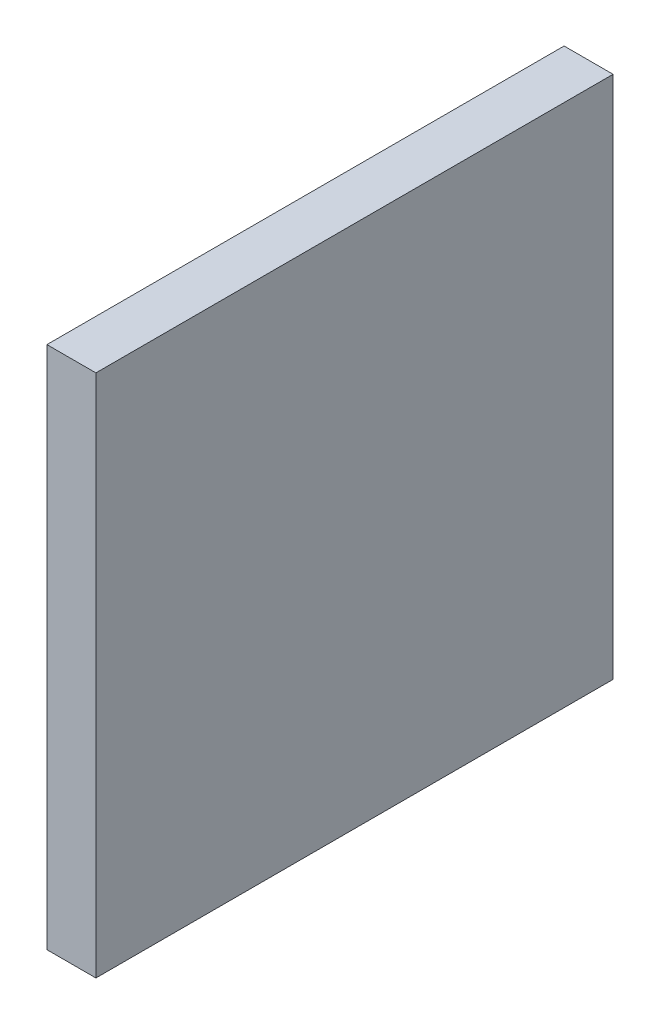
ISO-10303-21;
HEADER;
FILE_DESCRIPTION(('STEP AP214'),'2;1');
FILE_NAME('part.step','',(''),(''),'','','');
FILE_SCHEMA(('AUTOMOTIVE_DESIGN { 1 0 10303 214 1 1 1 1 }'));
ENDSEC;
DATA;
#1=APPLICATION_CONTEXT('core data for automotive mechanical design processes');
#2=APPLICATION_PROTOCOL_DEFINITION('international standard','automotive_design',2000,#1);
#3=PRODUCT_CONTEXT('',#1,'mechanical');
#4=PRODUCT('Part','Part','',(#3));
#5=PRODUCT_RELATED_PRODUCT_CATEGORY('part','',(#4));
#6=PRODUCT_DEFINITION_FORMATION('','',#4);
#7=PRODUCT_DEFINITION_CONTEXT('part definition',#1,'design');
#8=PRODUCT_DEFINITION('design','',#6,#7);
#9=PRODUCT_DEFINITION_SHAPE('','',#8);
#10=(LENGTH_UNIT() NAMED_UNIT(*) SI_UNIT(.MILLI.,.METRE.));
#11=(NAMED_UNIT(*) PLANE_ANGLE_UNIT() SI_UNIT($,.RADIAN.));
#12=(NAMED_UNIT(*) SI_UNIT($,.STERADIAN.) SOLID_ANGLE_UNIT());
#13=UNCERTAINTY_MEASURE_WITH_UNIT(LENGTH_MEASURE(1.E-05),#10,'distance_accuracy_value','');
#14=(GEOMETRIC_REPRESENTATION_CONTEXT(3) GLOBAL_UNCERTAINTY_ASSIGNED_CONTEXT((#13)) GLOBAL_UNIT_ASSIGNED_CONTEXT((#10,
#11,#12)) REPRESENTATION_CONTEXT('',''));
#15=CARTESIAN_POINT('',(0.,0.,0.));
#16=DIRECTION('',(0.,0.,1.));
#17=DIRECTION('',(1.,0.,0.));
#18=AXIS2_PLACEMENT_3D('',#15,#16,#17);
#19=CARTESIAN_POINT('',(-122.3,0.,-225.264426124935));
#20=DIRECTION('',(-1.,0.,0.));
#21=DIRECTION('',(0.,0.,1.));
#22=AXIS2_PLACEMENT_3D('',#19,#20,#21);
#23=PLANE('',#22);
#24=DIRECTION('',(0.,1.,0.));
#25=VECTOR('',#24,1.);
#26=CARTESIAN_POINT('',(-122.3,0.,-279.));
#27=LINE('',#26,#25);
#28=CARTESIAN_POINT('',(-122.3,-53.5024476045967,-279.));
#29=VERTEX_POINT('',#28);
#30=CARTESIAN_POINT('',(-122.3,0.,-279.));
#31=VERTEX_POINT('',#30);
#32=EDGE_CURVE('E83',#29,#31,#27,.T.);
#33=ORIENTED_EDGE('',*,*,#32,.F.);
#34=DIRECTION('',(0.,0.,-1.));
#35=VECTOR('',#34,1.);
#36=CARTESIAN_POINT('',(-122.3,-53.5024476045967,-225.264426124935));
#37=LINE('',#36,#35);
#38=CARTESIAN_POINT('',(-122.3,-53.5024476045967,-331.8));
#39=VERTEX_POINT('',#38);
#40=EDGE_CURVE('E37',#29,#39,#37,.T.);
#41=ORIENTED_EDGE('',*,*,#40,.T.);
#42=DIRECTION('',(0.,1.,0.));
#43=VECTOR('',#42,1.);
#44=CARTESIAN_POINT('',(-122.3,0.,-331.8));
#45=LINE('',#44,#43);
#46=CARTESIAN_POINT('',(-122.3,0.,-331.8));
#47=VERTEX_POINT('',#46);
#48=EDGE_CURVE('E81',#39,#47,#45,.T.);
#49=ORIENTED_EDGE('',*,*,#48,.T.);
#50=DIRECTION('',(0.,0.,-1.));
#51=VECTOR('',#50,1.);
#52=CARTESIAN_POINT('',(-122.3,0.,-225.264426124935));
#53=LINE('',#52,#51);
#54=EDGE_CURVE('E72',#31,#47,#53,.T.);
#55=ORIENTED_EDGE('',*,*,#54,.F.);
#56=EDGE_LOOP('',(#33,#41,#49,#55));
#57=FACE_BOUND('',#56,.T.);
#58=ADVANCED_FACE('F33',(#57),#23,.F.);
#59=CARTESIAN_POINT('',(-122.3,0.,-225.264426124935));
#60=DIRECTION('',(0.,-1.,0.));
#61=DIRECTION('',(0.,0.,-1.));
#62=AXIS2_PLACEMENT_3D('',#59,#60,#61);
#63=PLANE('',#62);
#64=DIRECTION('',(-1.,0.,0.));
#65=VECTOR('',#64,1.);
#66=CARTESIAN_POINT('',(-249.6,-4.44089209850063E-13,-279.));
#67=LINE('',#66,#65);
#68=CARTESIAN_POINT('',(-127.3,0.,-279.));
#69=VERTEX_POINT('',#68);
#70=EDGE_CURVE('E42',#31,#69,#67,.T.);
#71=ORIENTED_EDGE('',*,*,#70,.F.);
#72=ORIENTED_EDGE('',*,*,#54,.T.);
#73=DIRECTION('',(-1.,0.,0.));
#74=VECTOR('',#73,1.);
#75=CARTESIAN_POINT('',(-122.3,0.,-331.8));
#76=LINE('',#75,#74);
#77=CARTESIAN_POINT('',(-127.3,0.,-331.8));
#78=VERTEX_POINT('',#77);
#79=EDGE_CURVE('E93',#47,#78,#76,.T.);
#80=ORIENTED_EDGE('',*,*,#79,.T.);
#81=DIRECTION('',(0.,0.,-1.));
#82=VECTOR('',#81,1.);
#83=CARTESIAN_POINT('',(-127.3,0.,-225.264426124935));
#84=LINE('',#83,#82);
#85=EDGE_CURVE('E102',#69,#78,#84,.T.);
#86=ORIENTED_EDGE('',*,*,#85,.F.);
#87=EDGE_LOOP('',(#71,#72,#80,#86));
#88=FACE_BOUND('',#87,.T.);
#89=ADVANCED_FACE('F106',(#88),#63,.F.);
#90=CARTESIAN_POINT('',(-127.3,0.,-225.264426124935));
#91=DIRECTION('',(1.,0.,0.));
#92=DIRECTION('',(0.,0.,-1.));
#93=AXIS2_PLACEMENT_3D('',#90,#91,#92);
#94=PLANE('',#93);
#95=DIRECTION('',(0.,-1.,0.));
#96=VECTOR('',#95,1.);
#97=CARTESIAN_POINT('',(-127.3,0.,-279.));
#98=LINE('',#97,#96);
#99=CARTESIAN_POINT('',(-127.3,-53.5024476045967,-279.));
#100=VERTEX_POINT('',#99);
#101=EDGE_CURVE('E11',#69,#100,#98,.T.);
#102=ORIENTED_EDGE('',*,*,#101,.F.);
#103=ORIENTED_EDGE('',*,*,#85,.T.);
#104=DIRECTION('',(0.,-1.,0.));
#105=VECTOR('',#104,1.);
#106=CARTESIAN_POINT('',(-127.3,0.,-331.8));
#107=LINE('',#106,#105);
#108=CARTESIAN_POINT('',(-127.3,-53.5024476045967,-331.8));
#109=VERTEX_POINT('',#108);
#110=EDGE_CURVE('E103',#78,#109,#107,.T.);
#111=ORIENTED_EDGE('',*,*,#110,.T.);
#112=DIRECTION('',(0.,0.,-1.));
#113=VECTOR('',#112,1.);
#114=CARTESIAN_POINT('',(-127.3,-53.5024476045967,-225.264426124935));
#115=LINE('',#114,#113);
#116=EDGE_CURVE('E55',#100,#109,#115,.T.);
#117=ORIENTED_EDGE('',*,*,#116,.F.);
#118=EDGE_LOOP('',(#102,#103,#111,#117));
#119=FACE_BOUND('',#118,.T.);
#120=ADVANCED_FACE('F105',(#119),#94,.F.);
#121=CARTESIAN_POINT('',(-122.3,-53.5024476045967,-225.264426124935));
#122=DIRECTION('',(0.,1.,0.));
#123=DIRECTION('',(0.,0.,1.));
#124=AXIS2_PLACEMENT_3D('',#121,#122,#123);
#125=PLANE('',#124);
#126=DIRECTION('',(1.,0.,0.));
#127=VECTOR('',#126,1.);
#128=CARTESIAN_POINT('',(-122.3,-53.5024476045967,-279.));
#129=LINE('',#128,#127);
#130=EDGE_CURVE('E90',#100,#29,#129,.T.);
#131=ORIENTED_EDGE('',*,*,#130,.F.);
#132=ORIENTED_EDGE('',*,*,#116,.T.);
#133=DIRECTION('',(1.,0.,0.));
#134=VECTOR('',#133,1.);
#135=CARTESIAN_POINT('',(-122.3,-53.5024476045967,-331.8));
#136=LINE('',#135,#134);
#137=EDGE_CURVE('E86',#109,#39,#136,.T.);
#138=ORIENTED_EDGE('',*,*,#137,.T.);
#139=ORIENTED_EDGE('',*,*,#40,.F.);
#140=EDGE_LOOP('',(#131,#132,#138,#139));
#141=FACE_BOUND('',#140,.T.);
#142=ADVANCED_FACE('F87',(#141),#125,.F.);
#143=CARTESIAN_POINT('',(0.,0.,-331.8));
#144=DIRECTION('',(0.,0.,-1.));
#145=DIRECTION('',(-1.,0.,0.));
#146=AXIS2_PLACEMENT_3D('',#143,#144,#145);
#147=PLANE('',#146);
#148=ORIENTED_EDGE('',*,*,#48,.F.);
#149=ORIENTED_EDGE('',*,*,#137,.F.);
#150=ORIENTED_EDGE('',*,*,#110,.F.);
#151=ORIENTED_EDGE('',*,*,#79,.F.);
#152=EDGE_LOOP('',(#148,#149,#150,#151));
#153=FACE_BOUND('',#152,.T.);
#154=ADVANCED_FACE('F92',(#153),#147,.T.);
#155=CARTESIAN_POINT('',(-249.600000000001,69.0000000000022,-279.));
#156=DIRECTION('',(0.,0.,1.));
#157=DIRECTION('',(1.,0.,0.));
#158=AXIS2_PLACEMENT_3D('',#155,#156,#157);
#159=PLANE('',#158);
#160=ORIENTED_EDGE('',*,*,#130,.T.);
#161=ORIENTED_EDGE('',*,*,#32,.T.);
#162=ORIENTED_EDGE('',*,*,#70,.T.);
#163=ORIENTED_EDGE('',*,*,#101,.T.);
#164=EDGE_LOOP('',(#160,#161,#162,#163));
#165=FACE_BOUND('',#164,.T.);
#166=ADVANCED_FACE('F35',(#165),#159,.T.);
#167=CLOSED_SHELL('',(#58,#89,#120,#142,#154,#166));
#168=MANIFOLD_SOLID_BREP('B2',#167);
#169=ADVANCED_BREP_SHAPE_REPRESENTATION('',(#18,#168),#14);
#170=SHAPE_DEFINITION_REPRESENTATION(#9,#169);
ENDSEC;
END-ISO-10303-21;
